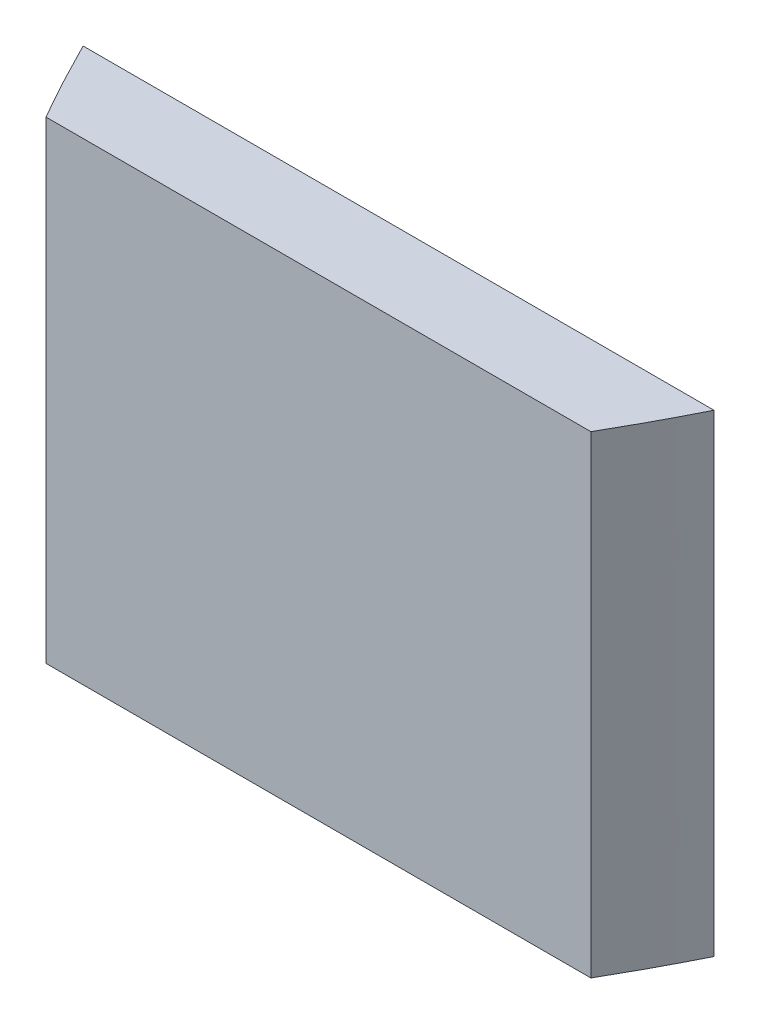
ISO-10303-21;
HEADER;
FILE_DESCRIPTION(('STEP AP214'),'2;1');
FILE_NAME('part.step','',(''),(''),'','','');
FILE_SCHEMA(('AUTOMOTIVE_DESIGN { 1 0 10303 214 1 1 1 1 }'));
ENDSEC;
DATA;
#1=APPLICATION_CONTEXT('core data for automotive mechanical design processes');
#2=APPLICATION_PROTOCOL_DEFINITION('international standard','automotive_design',2000,#1);
#3=PRODUCT_CONTEXT('',#1,'mechanical');
#4=PRODUCT('Part','Part','',(#3));
#5=PRODUCT_RELATED_PRODUCT_CATEGORY('part','',(#4));
#6=PRODUCT_DEFINITION_FORMATION('','',#4);
#7=PRODUCT_DEFINITION_CONTEXT('part definition',#1,'design');
#8=PRODUCT_DEFINITION('design','',#6,#7);
#9=PRODUCT_DEFINITION_SHAPE('','',#8);
#10=(LENGTH_UNIT() NAMED_UNIT(*) SI_UNIT(.MILLI.,.METRE.));
#11=(NAMED_UNIT(*) PLANE_ANGLE_UNIT() SI_UNIT($,.RADIAN.));
#12=(NAMED_UNIT(*) SI_UNIT($,.STERADIAN.) SOLID_ANGLE_UNIT());
#13=UNCERTAINTY_MEASURE_WITH_UNIT(LENGTH_MEASURE(1.E-05),#10,'distance_accuracy_value','');
#14=(GEOMETRIC_REPRESENTATION_CONTEXT(3) GLOBAL_UNCERTAINTY_ASSIGNED_CONTEXT((#13)) GLOBAL_UNIT_ASSIGNED_CONTEXT((#10,
#11,#12)) REPRESENTATION_CONTEXT('',''));
#15=CARTESIAN_POINT('',(0.,0.,0.));
#16=DIRECTION('',(0.,0.,1.));
#17=DIRECTION('',(1.,0.,0.));
#18=AXIS2_PLACEMENT_3D('',#15,#16,#17);
#19=CARTESIAN_POINT('',(-200.000000000337,300.,-6.70196537155832E-10));
#20=CARTESIAN_POINT('',(-5.91540705308091E-11,300.,400.000000000552));
#21=CARTESIAN_POINT('',(200.000000000219,300.,-4.34305369445553E-10));
#22=B_SPLINE_CURVE_WITH_KNOTS('',2,(#19,#20,#21),.UNSPECIFIED.,.F.,.F.,(3,3),(0.056028396232078,
0.943971603767659),.UNSPECIFIED.);
#23=DIRECTION('',(0.,-1.,0.));
#24=VECTOR('',#23,1.);
#25=SURFACE_OF_LINEAR_EXTRUSION('',#22,#24);
#26=DIRECTION('',(0.,-1.,0.));
#27=VECTOR('',#26,1.);
#28=CARTESIAN_POINT('',(-172.742583053825,300.,50.7999999994648));
#29=LINE('',#28,#27);
#30=CARTESIAN_POINT('',(-172.742583042524,300.,50.7999999994648));
#31=VERTEX_POINT('',#30);
#32=CARTESIAN_POINT('',(-172.742583042524,0.,50.8000000189874));
#33=VERTEX_POINT('',#32);
#34=EDGE_CURVE('E48',#31,#33,#29,.T.);
#35=ORIENTED_EDGE('',*,*,#34,.F.);
#36=CARTESIAN_POINT('',(-200.00000000027,300.,-5.35238059385865E-10));
#37=VERTEX_POINT('',#36);
#38=EDGE_CURVE('E83',#37,#31,#22,.T.);
#39=ORIENTED_EDGE('',*,*,#38,.F.);
#40=DIRECTION('',(0.,-1.,0.));
#41=VECTOR('',#40,1.);
#42=CARTESIAN_POINT('',(-200.00000000027,300.,-5.35238059385865E-10));
#43=LINE('',#42,#41);
#44=CARTESIAN_POINT('',(-200.00000000027,0.,-5.35238059385865E-10));
#45=VERTEX_POINT('',#44);
#46=EDGE_CURVE('E72',#37,#45,#43,.T.);
#47=ORIENTED_EDGE('',*,*,#46,.T.);
#48=CARTESIAN_POINT('',(-200.000000000337,0.,-6.70196537155832E-10));
#49=CARTESIAN_POINT('',(-5.91540705308091E-11,0.,400.000000000552));
#50=CARTESIAN_POINT('',(200.000000000219,0.,-4.34305369445553E-10));
#51=B_SPLINE_CURVE_WITH_KNOTS('',2,(#48,#49,#50),.UNSPECIFIED.,.F.,.F.,(3,3),(0.056028396232078,
0.943971603767659),.UNSPECIFIED.);
#52=EDGE_CURVE('E79',#45,#33,#51,.T.);
#53=ORIENTED_EDGE('',*,*,#52,.T.);
#54=EDGE_LOOP('',(#35,#39,#47,#53));
#55=FACE_BOUND('',#54,.T.);
#56=ADVANCED_FACE('F33',(#55),#25,.F.);
#57=DIRECTION('',(0.,-1.,0.));
#58=VECTOR('',#57,1.);
#59=CARTESIAN_POINT('',(172.742583053825,300.,50.7999999994648));
#60=LINE('',#59,#58);
#61=CARTESIAN_POINT('',(172.742583042523,0.,50.7999999994648));
#62=VERTEX_POINT('',#61);
#63=CARTESIAN_POINT('',(172.742583042523,300.,50.7999999994648));
#64=VERTEX_POINT('',#63);
#65=EDGE_CURVE('E102',#62,#64,#60,.F.);
#66=ORIENTED_EDGE('',*,*,#65,.F.);
#67=CARTESIAN_POINT('',(200.000000000156,0.,-5.35238059385865E-10));
#68=VERTEX_POINT('',#67);
#69=EDGE_CURVE('E86',#62,#68,#51,.T.);
#70=ORIENTED_EDGE('',*,*,#69,.T.);
#71=DIRECTION('',(0.,-1.,0.));
#72=VECTOR('',#71,1.);
#73=CARTESIAN_POINT('',(200.000000000156,300.,-5.35238059385865E-10));
#74=LINE('',#73,#72);
#75=CARTESIAN_POINT('',(200.000000000156,300.,-5.35238059385865E-10));
#76=VERTEX_POINT('',#75);
#77=EDGE_CURVE('E41',#76,#68,#74,.T.);
#78=ORIENTED_EDGE('',*,*,#77,.F.);
#79=EDGE_CURVE('E78',#64,#76,#22,.T.);
#80=ORIENTED_EDGE('',*,*,#79,.F.);
#81=EDGE_LOOP('',(#66,#70,#78,#80));
#82=FACE_BOUND('',#81,.T.);
#83=ADVANCED_FACE('F114',(#82),#25,.F.);
#84=CARTESIAN_POINT('',(-5.9161009424713E-11,300.,200.));
#85=DIRECTION('',(0.,-1.,0.));
#86=DIRECTION('',(0.,0.,-1.));
#87=AXIS2_PLACEMENT_3D('',#84,#85,#86);
#88=PLANE('',#87);
#89=DIRECTION('',(1.,0.,0.));
#90=VECTOR('',#89,1.);
#91=CARTESIAN_POINT('',(-219.330517822261,300.,50.7999999994648));
#92=LINE('',#91,#90);
#93=EDGE_CURVE('E105',#31,#64,#92,.T.);
#94=ORIENTED_EDGE('',*,*,#93,.T.);
#95=ORIENTED_EDGE('',*,*,#79,.T.);
#96=DIRECTION('',(-1.,0.,0.));
#97=VECTOR('',#96,1.);
#98=CARTESIAN_POINT('',(-200.00000000027,300.,-5.35238059385865E-10));
#99=LINE('',#98,#97);
#100=EDGE_CURVE('E56',#76,#37,#99,.T.);
#101=ORIENTED_EDGE('',*,*,#100,.T.);
#102=ORIENTED_EDGE('',*,*,#38,.T.);
#103=EDGE_LOOP('',(#94,#95,#101,#102));
#104=FACE_BOUND('',#103,.T.);
#105=ADVANCED_FACE('F109',(#104),#88,.F.);
#106=CARTESIAN_POINT('',(-5.9161009424713E-11,0.,200.));
#107=DIRECTION('',(0.,-1.,0.));
#108=DIRECTION('',(0.,0.,-1.));
#109=AXIS2_PLACEMENT_3D('',#106,#107,#108);
#110=PLANE('',#109);
#111=ORIENTED_EDGE('',*,*,#69,.F.);
#112=DIRECTION('',(-1.,0.,0.));
#113=VECTOR('',#112,1.);
#114=CARTESIAN_POINT('',(-5.9161009424713E-11,0.,50.7999999994648));
#115=LINE('',#114,#113);
#116=EDGE_CURVE('E11',#62,#33,#115,.T.);
#117=ORIENTED_EDGE('',*,*,#116,.T.);
#118=ORIENTED_EDGE('',*,*,#52,.F.);
#119=DIRECTION('',(-1.,0.,0.));
#120=VECTOR('',#119,1.);
#121=CARTESIAN_POINT('',(-200.00000000027,0.,-5.35238059385865E-10));
#122=LINE('',#121,#120);
#123=EDGE_CURVE('E69',#68,#45,#122,.T.);
#124=ORIENTED_EDGE('',*,*,#123,.F.);
#125=EDGE_LOOP('',(#111,#117,#118,#124));
#126=FACE_BOUND('',#125,.T.);
#127=ADVANCED_FACE('F85',(#126),#110,.T.);
#128=CARTESIAN_POINT('',(-200.00000000027,300.,-5.35238059385865E-10));
#129=DIRECTION('',(0.,0.,1.));
#130=DIRECTION('',(1.,0.,0.));
#131=AXIS2_PLACEMENT_3D('',#128,#129,#130);
#132=PLANE('',#131);
#133=ORIENTED_EDGE('',*,*,#123,.T.);
#134=ORIENTED_EDGE('',*,*,#46,.F.);
#135=ORIENTED_EDGE('',*,*,#100,.F.);
#136=ORIENTED_EDGE('',*,*,#77,.T.);
#137=EDGE_LOOP('',(#133,#134,#135,#136));
#138=FACE_BOUND('',#137,.T.);
#139=ADVANCED_FACE('F71',(#138),#132,.F.);
#140=CARTESIAN_POINT('',(-219.330517822261,-50.,50.7999999994648));
#141=DIRECTION('',(0.,0.,1.));
#142=DIRECTION('',(1.,0.,0.));
#143=AXIS2_PLACEMENT_3D('',#140,#141,#142);
#144=PLANE('',#143);
#145=ORIENTED_EDGE('',*,*,#34,.T.);
#146=ORIENTED_EDGE('',*,*,#116,.F.);
#147=ORIENTED_EDGE('',*,*,#65,.T.);
#148=ORIENTED_EDGE('',*,*,#93,.F.);
#149=EDGE_LOOP('',(#145,#146,#147,#148));
#150=FACE_BOUND('',#149,.T.);
#151=ADVANCED_FACE('F116',(#150),#144,.T.);
#152=CLOSED_SHELL('',(#56,#83,#105,#127,#139,#151));
#153=MANIFOLD_SOLID_BREP('B2',#152);
#154=ADVANCED_BREP_SHAPE_REPRESENTATION('',(#18,#153),#14);
#155=SHAPE_DEFINITION_REPRESENTATION(#9,#154);
ENDSEC;
END-ISO-10303-21;
